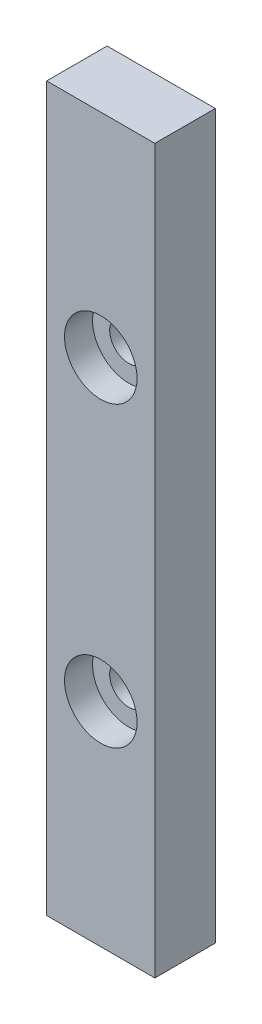
ISO-10303-21;
HEADER;
FILE_DESCRIPTION(('STEP AP214'),'2;1');
FILE_NAME('part.step','',(''),(''),'','','');
FILE_SCHEMA(('AUTOMOTIVE_DESIGN { 1 0 10303 214 1 1 1 1 }'));
ENDSEC;
DATA;
#1=APPLICATION_CONTEXT('core data for automotive mechanical design processes');
#2=APPLICATION_PROTOCOL_DEFINITION('international standard','automotive_design',2000,#1);
#3=PRODUCT_CONTEXT('',#1,'mechanical');
#4=PRODUCT('Part','Part','',(#3));
#5=PRODUCT_RELATED_PRODUCT_CATEGORY('part','',(#4));
#6=PRODUCT_DEFINITION_FORMATION('','',#4);
#7=PRODUCT_DEFINITION_CONTEXT('part definition',#1,'design');
#8=PRODUCT_DEFINITION('design','',#6,#7);
#9=PRODUCT_DEFINITION_SHAPE('','',#8);
#10=(LENGTH_UNIT() NAMED_UNIT(*) SI_UNIT(.MILLI.,.METRE.));
#11=(NAMED_UNIT(*) PLANE_ANGLE_UNIT() SI_UNIT($,.RADIAN.));
#12=(NAMED_UNIT(*) SI_UNIT($,.STERADIAN.) SOLID_ANGLE_UNIT());
#13=UNCERTAINTY_MEASURE_WITH_UNIT(LENGTH_MEASURE(1.E-05),#10,'distance_accuracy_value','');
#14=(GEOMETRIC_REPRESENTATION_CONTEXT(3) GLOBAL_UNCERTAINTY_ASSIGNED_CONTEXT((#13)) GLOBAL_UNIT_ASSIGNED_CONTEXT((#10,
#11,#12)) REPRESENTATION_CONTEXT('',''));
#15=CARTESIAN_POINT('',(0.,0.,0.));
#16=DIRECTION('',(0.,0.,1.));
#17=DIRECTION('',(1.,0.,0.));
#18=AXIS2_PLACEMENT_3D('',#15,#16,#17);
#19=CARTESIAN_POINT('',(4.25,-40.1,4.75));
#20=DIRECTION('',(0.,0.,1.));
#21=DIRECTION('',(1.,0.,0.));
#22=AXIS2_PLACEMENT_3D('',#19,#20,#21);
#23=CYLINDRICAL_SURFACE('',#22,1.5);
#24=CARTESIAN_POINT('',(4.25,-40.1,0.));
#25=DIRECTION('',(0.,0.,1.));
#26=DIRECTION('',(1.,0.,0.));
#27=AXIS2_PLACEMENT_3D('',#24,#25,#26);
#28=CIRCLE('',#27,1.5);
#29=CARTESIAN_POINT('',(5.75,-40.1,0.));
#30=VERTEX_POINT('',#29);
#31=EDGE_CURVE('E103',#30,#30,#28,.T.);
#32=ORIENTED_EDGE('',*,*,#31,.F.);
#33=EDGE_LOOP('',(#32));
#34=FACE_BOUND('',#33,.T.);
#35=CARTESIAN_POINT('',(4.25,-40.1,2.55));
#36=DIRECTION('',(0.,0.,1.));
#37=DIRECTION('',(1.,0.,0.));
#38=AXIS2_PLACEMENT_3D('',#35,#36,#37);
#39=CIRCLE('',#38,1.5);
#40=CARTESIAN_POINT('',(5.75,-40.1,2.55));
#41=VERTEX_POINT('',#40);
#42=EDGE_CURVE('E37',#41,#41,#39,.F.);
#43=ORIENTED_EDGE('',*,*,#42,.F.);
#44=EDGE_LOOP('',(#43));
#45=FACE_BOUND('',#44,.T.);
#46=ADVANCED_FACE('F33',(#34,#45),#23,.F.);
#47=CARTESIAN_POINT('',(4.25,-16.7,4.75));
#48=DIRECTION('',(0.,0.,1.));
#49=DIRECTION('',(1.,0.,0.));
#50=AXIS2_PLACEMENT_3D('',#47,#48,#49);
#51=CYLINDRICAL_SURFACE('',#50,1.5);
#52=CARTESIAN_POINT('',(4.25,-16.7,0.));
#53=DIRECTION('',(0.,0.,1.));
#54=DIRECTION('',(1.,0.,0.));
#55=AXIS2_PLACEMENT_3D('',#52,#53,#54);
#56=CIRCLE('',#55,1.5);
#57=CARTESIAN_POINT('',(5.75,-16.7,0.));
#58=VERTEX_POINT('',#57);
#59=EDGE_CURVE('E109',#58,#58,#56,.T.);
#60=ORIENTED_EDGE('',*,*,#59,.F.);
#61=EDGE_LOOP('',(#60));
#62=FACE_BOUND('',#61,.T.);
#63=CARTESIAN_POINT('',(4.25,-16.7,2.55));
#64=DIRECTION('',(0.,0.,1.));
#65=DIRECTION('',(1.,0.,0.));
#66=AXIS2_PLACEMENT_3D('',#63,#64,#65);
#67=CIRCLE('',#66,1.5);
#68=CARTESIAN_POINT('',(5.75,-16.7,2.55));
#69=VERTEX_POINT('',#68);
#70=EDGE_CURVE('E111',#69,#69,#67,.F.);
#71=ORIENTED_EDGE('',*,*,#70,.F.);
#72=EDGE_LOOP('',(#71));
#73=FACE_BOUND('',#72,.T.);
#74=ADVANCED_FACE('F139',(#62,#73),#51,.F.);
#75=CARTESIAN_POINT('',(0.,0.,4.75));
#76=DIRECTION('',(1.,0.,0.));
#77=DIRECTION('',(0.,1.,0.));
#78=AXIS2_PLACEMENT_3D('',#75,#76,#77);
#79=PLANE('',#78);
#80=DIRECTION('',(0.,-1.,0.));
#81=VECTOR('',#80,1.);
#82=CARTESIAN_POINT('',(0.,0.,0.));
#83=LINE('',#82,#81);
#84=CARTESIAN_POINT('',(0.,0.,0.));
#85=VERTEX_POINT('',#84);
#86=CARTESIAN_POINT('',(0.,-56.8,0.));
#87=VERTEX_POINT('',#86);
#88=EDGE_CURVE('E100',#85,#87,#83,.T.);
#89=ORIENTED_EDGE('',*,*,#88,.T.);
#90=DIRECTION('',(0.,0.,-1.));
#91=VECTOR('',#90,1.);
#92=CARTESIAN_POINT('',(0.,-56.8,4.75));
#93=LINE('',#92,#91);
#94=CARTESIAN_POINT('',(0.,-56.8,4.75));
#95=VERTEX_POINT('',#94);
#96=EDGE_CURVE('E11',#95,#87,#93,.T.);
#97=ORIENTED_EDGE('',*,*,#96,.F.);
#98=DIRECTION('',(0.,-1.,0.));
#99=VECTOR('',#98,1.);
#100=CARTESIAN_POINT('',(0.,0.,4.75));
#101=LINE('',#100,#99);
#102=CARTESIAN_POINT('',(0.,0.,4.75));
#103=VERTEX_POINT('',#102);
#104=EDGE_CURVE('E87',#103,#95,#101,.T.);
#105=ORIENTED_EDGE('',*,*,#104,.F.);
#106=DIRECTION('',(0.,0.,-1.));
#107=VECTOR('',#106,1.);
#108=CARTESIAN_POINT('',(0.,0.,4.75));
#109=LINE('',#108,#107);
#110=EDGE_CURVE('E96',#103,#85,#109,.T.);
#111=ORIENTED_EDGE('',*,*,#110,.T.);
#112=EDGE_LOOP('',(#89,#97,#105,#111));
#113=FACE_BOUND('',#112,.T.);
#114=ADVANCED_FACE('F35',(#113),#79,.F.);
#115=CARTESIAN_POINT('',(0.,-56.8,4.75));
#116=DIRECTION('',(0.,1.,0.));
#117=DIRECTION('',(0.,0.,1.));
#118=AXIS2_PLACEMENT_3D('',#115,#116,#117);
#119=PLANE('',#118);
#120=DIRECTION('',(1.,0.,0.));
#121=VECTOR('',#120,1.);
#122=CARTESIAN_POINT('',(0.,-56.8,0.));
#123=LINE('',#122,#121);
#124=CARTESIAN_POINT('',(8.50000000000001,-56.8,0.));
#125=VERTEX_POINT('',#124);
#126=EDGE_CURVE('E91',#87,#125,#123,.T.);
#127=ORIENTED_EDGE('',*,*,#126,.T.);
#128=DIRECTION('',(0.,0.,-1.));
#129=VECTOR('',#128,1.);
#130=CARTESIAN_POINT('',(8.50000000000001,-56.8,4.75));
#131=LINE('',#130,#129);
#132=CARTESIAN_POINT('',(8.50000000000001,-56.8,4.75));
#133=VERTEX_POINT('',#132);
#134=EDGE_CURVE('E43',#133,#125,#131,.T.);
#135=ORIENTED_EDGE('',*,*,#134,.F.);
#136=DIRECTION('',(1.,0.,0.));
#137=VECTOR('',#136,1.);
#138=CARTESIAN_POINT('',(0.,-56.8,4.75));
#139=LINE('',#138,#137);
#140=EDGE_CURVE('E82',#95,#133,#139,.T.);
#141=ORIENTED_EDGE('',*,*,#140,.F.);
#142=ORIENTED_EDGE('',*,*,#96,.T.);
#143=EDGE_LOOP('',(#127,#135,#141,#142));
#144=FACE_BOUND('',#143,.T.);
#145=ADVANCED_FACE('F90',(#144),#119,.F.);
#146=CARTESIAN_POINT('',(8.5,0.,4.75));
#147=DIRECTION('',(-1.,0.,0.));
#148=DIRECTION('',(0.,-1.,0.));
#149=AXIS2_PLACEMENT_3D('',#146,#147,#148);
#150=PLANE('',#149);
#151=DIRECTION('',(0.,1.,0.));
#152=VECTOR('',#151,1.);
#153=CARTESIAN_POINT('',(8.5,0.,0.));
#154=LINE('',#153,#152);
#155=CARTESIAN_POINT('',(8.5,0.,0.));
#156=VERTEX_POINT('',#155);
#157=EDGE_CURVE('E69',#125,#156,#154,.T.);
#158=ORIENTED_EDGE('',*,*,#157,.T.);
#159=DIRECTION('',(0.,0.,-1.));
#160=VECTOR('',#159,1.);
#161=CARTESIAN_POINT('',(8.5,0.,4.75));
#162=LINE('',#161,#160);
#163=CARTESIAN_POINT('',(8.5,0.,4.75));
#164=VERTEX_POINT('',#163);
#165=EDGE_CURVE('E92',#164,#156,#162,.T.);
#166=ORIENTED_EDGE('',*,*,#165,.F.);
#167=DIRECTION('',(0.,1.,0.));
#168=VECTOR('',#167,1.);
#169=CARTESIAN_POINT('',(8.5,0.,4.75));
#170=LINE('',#169,#168);
#171=EDGE_CURVE('E85',#133,#164,#170,.T.);
#172=ORIENTED_EDGE('',*,*,#171,.F.);
#173=ORIENTED_EDGE('',*,*,#134,.T.);
#174=EDGE_LOOP('',(#158,#166,#172,#173));
#175=FACE_BOUND('',#174,.T.);
#176=ADVANCED_FACE('F94',(#175),#150,.F.);
#177=CARTESIAN_POINT('',(0.,0.,4.75));
#178=DIRECTION('',(0.,-1.,0.));
#179=DIRECTION('',(0.,0.,-1.));
#180=AXIS2_PLACEMENT_3D('',#177,#178,#179);
#181=PLANE('',#180);
#182=DIRECTION('',(-1.,0.,0.));
#183=VECTOR('',#182,1.);
#184=CARTESIAN_POINT('',(0.,0.,0.));
#185=LINE('',#184,#183);
#186=EDGE_CURVE('E75',#156,#85,#185,.T.);
#187=ORIENTED_EDGE('',*,*,#186,.T.);
#188=ORIENTED_EDGE('',*,*,#110,.F.);
#189=DIRECTION('',(-1.,0.,0.));
#190=VECTOR('',#189,1.);
#191=CARTESIAN_POINT('',(0.,0.,4.75));
#192=LINE('',#191,#190);
#193=EDGE_CURVE('E52',#164,#103,#192,.T.);
#194=ORIENTED_EDGE('',*,*,#193,.F.);
#195=ORIENTED_EDGE('',*,*,#165,.T.);
#196=EDGE_LOOP('',(#187,#188,#194,#195));
#197=FACE_BOUND('',#196,.T.);
#198=ADVANCED_FACE('F165',(#197),#181,.F.);
#199=CARTESIAN_POINT('',(0.,0.,4.75));
#200=DIRECTION('',(0.,0.,1.));
#201=DIRECTION('',(1.,0.,0.));
#202=AXIS2_PLACEMENT_3D('',#199,#200,#201);
#203=PLANE('',#202);
#204=CARTESIAN_POINT('',(4.25,-16.7,4.75));
#205=DIRECTION('',(0.,0.,1.));
#206=DIRECTION('',(1.,0.,0.));
#207=AXIS2_PLACEMENT_3D('',#204,#205,#206);
#208=CIRCLE('',#207,2.85);
#209=CARTESIAN_POINT('',(7.1,-16.7,4.75));
#210=VERTEX_POINT('',#209);
#211=EDGE_CURVE('E118',#210,#210,#208,.T.);
#212=ORIENTED_EDGE('',*,*,#211,.F.);
#213=EDGE_LOOP('',(#212));
#214=FACE_BOUND('',#213,.T.);
#215=CARTESIAN_POINT('',(4.25,-40.1,4.75));
#216=DIRECTION('',(0.,0.,1.));
#217=DIRECTION('',(1.,0.,0.));
#218=AXIS2_PLACEMENT_3D('',#215,#216,#217);
#219=CIRCLE('',#218,2.85);
#220=CARTESIAN_POINT('',(7.1,-40.1,4.75));
#221=VERTEX_POINT('',#220);
#222=EDGE_CURVE('E128',#221,#221,#219,.T.);
#223=ORIENTED_EDGE('',*,*,#222,.F.);
#224=EDGE_LOOP('',(#223));
#225=FACE_BOUND('',#224,.T.);
#226=ORIENTED_EDGE('',*,*,#104,.T.);
#227=ORIENTED_EDGE('',*,*,#140,.T.);
#228=ORIENTED_EDGE('',*,*,#171,.T.);
#229=ORIENTED_EDGE('',*,*,#193,.T.);
#230=EDGE_LOOP('',(#226,#227,#228,#229));
#231=FACE_BOUND('',#230,.T.);
#232=ADVANCED_FACE('F83',(#214,#225,#231),#203,.T.);
#233=CARTESIAN_POINT('',(0.,0.,0.));
#234=DIRECTION('',(0.,0.,1.));
#235=DIRECTION('',(1.,0.,0.));
#236=AXIS2_PLACEMENT_3D('',#233,#234,#235);
#237=PLANE('',#236);
#238=ORIENTED_EDGE('',*,*,#59,.T.);
#239=EDGE_LOOP('',(#238));
#240=FACE_BOUND('',#239,.T.);
#241=ORIENTED_EDGE('',*,*,#31,.T.);
#242=EDGE_LOOP('',(#241));
#243=FACE_BOUND('',#242,.T.);
#244=ORIENTED_EDGE('',*,*,#88,.F.);
#245=ORIENTED_EDGE('',*,*,#186,.F.);
#246=ORIENTED_EDGE('',*,*,#157,.F.);
#247=ORIENTED_EDGE('',*,*,#126,.F.);
#248=EDGE_LOOP('',(#244,#245,#246,#247));
#249=FACE_BOUND('',#248,.T.);
#250=ADVANCED_FACE('F134',(#240,#243,#249),#237,.F.);
#251=CARTESIAN_POINT('',(4.25,-16.7,2.55));
#252=DIRECTION('',(0.,0.,1.));
#253=DIRECTION('',(1.,0.,0.));
#254=AXIS2_PLACEMENT_3D('',#251,#252,#253);
#255=PLANE('',#254);
#256=CARTESIAN_POINT('',(4.25,-16.7,2.55));
#257=DIRECTION('',(0.,0.,1.));
#258=DIRECTION('',(1.,0.,0.));
#259=AXIS2_PLACEMENT_3D('',#256,#257,#258);
#260=CIRCLE('',#259,2.85);
#261=CARTESIAN_POINT('',(7.1,-16.7,2.55));
#262=VERTEX_POINT('',#261);
#263=EDGE_CURVE('E113',#262,#262,#260,.T.);
#264=ORIENTED_EDGE('',*,*,#263,.T.);
#265=EDGE_LOOP('',(#264));
#266=FACE_BOUND('',#265,.T.);
#267=ORIENTED_EDGE('',*,*,#70,.T.);
#268=EDGE_LOOP('',(#267));
#269=FACE_BOUND('',#268,.T.);
#270=ADVANCED_FACE('F155',(#266,#269),#255,.T.);
#271=CARTESIAN_POINT('',(4.25,-16.7,2.55));
#272=DIRECTION('',(0.,0.,1.));
#273=DIRECTION('',(1.,0.,0.));
#274=AXIS2_PLACEMENT_3D('',#271,#272,#273);
#275=CYLINDRICAL_SURFACE('',#274,2.85);
#276=ORIENTED_EDGE('',*,*,#263,.F.);
#277=EDGE_LOOP('',(#276));
#278=FACE_BOUND('',#277,.T.);
#279=ORIENTED_EDGE('',*,*,#211,.T.);
#280=EDGE_LOOP('',(#279));
#281=FACE_BOUND('',#280,.T.);
#282=ADVANCED_FACE('F146',(#278,#281),#275,.F.);
#283=CARTESIAN_POINT('',(4.25,-40.1,2.55));
#284=DIRECTION('',(0.,0.,1.));
#285=DIRECTION('',(1.,0.,0.));
#286=AXIS2_PLACEMENT_3D('',#283,#284,#285);
#287=PLANE('',#286);
#288=CARTESIAN_POINT('',(4.25,-40.1,2.55));
#289=DIRECTION('',(0.,0.,1.));
#290=DIRECTION('',(1.,0.,0.));
#291=AXIS2_PLACEMENT_3D('',#288,#289,#290);
#292=CIRCLE('',#291,2.85);
#293=CARTESIAN_POINT('',(7.1,-40.1,2.55));
#294=VERTEX_POINT('',#293);
#295=EDGE_CURVE('E123',#294,#294,#292,.T.);
#296=ORIENTED_EDGE('',*,*,#295,.T.);
#297=EDGE_LOOP('',(#296));
#298=FACE_BOUND('',#297,.T.);
#299=ORIENTED_EDGE('',*,*,#42,.T.);
#300=EDGE_LOOP('',(#299));
#301=FACE_BOUND('',#300,.T.);
#302=ADVANCED_FACE('F143',(#298,#301),#287,.T.);
#303=CARTESIAN_POINT('',(4.25,-40.1,2.55));
#304=DIRECTION('',(0.,0.,1.));
#305=DIRECTION('',(1.,0.,0.));
#306=AXIS2_PLACEMENT_3D('',#303,#304,#305);
#307=CYLINDRICAL_SURFACE('',#306,2.85);
#308=ORIENTED_EDGE('',*,*,#295,.F.);
#309=EDGE_LOOP('',(#308));
#310=FACE_BOUND('',#309,.T.);
#311=ORIENTED_EDGE('',*,*,#222,.T.);
#312=EDGE_LOOP('',(#311));
#313=FACE_BOUND('',#312,.T.);
#314=ADVANCED_FACE('F145',(#310,#313),#307,.F.);
#315=CLOSED_SHELL('',(#46,#74,#114,#145,#176,#198,#232,#250,#270,#282,#302,#314));
#316=MANIFOLD_SOLID_BREP('B2',#315);
#317=ADVANCED_BREP_SHAPE_REPRESENTATION('',(#18,#316),#14);
#318=SHAPE_DEFINITION_REPRESENTATION(#9,#317);
ENDSEC;
END-ISO-10303-21;
